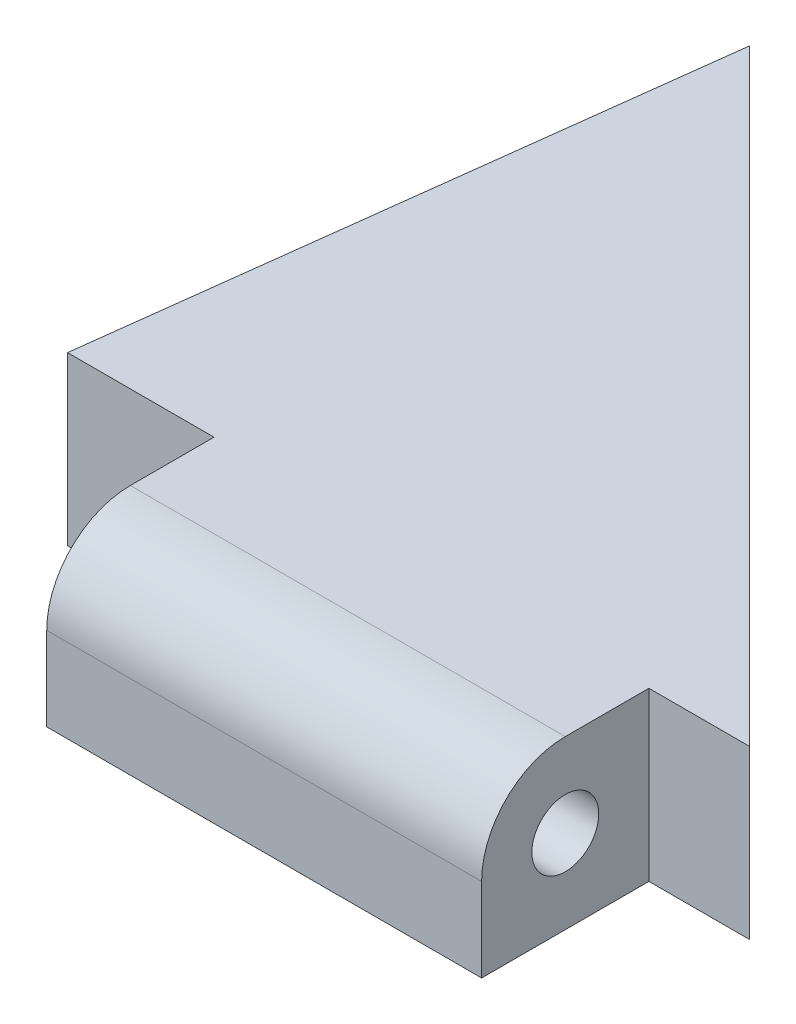
ISO-10303-21;
HEADER;
FILE_DESCRIPTION(('STEP AP214'),'2;1');
FILE_NAME('part.step','',(''),(''),'','','');
FILE_SCHEMA(('AUTOMOTIVE_DESIGN { 1 0 10303 214 1 1 1 1 }'));
ENDSEC;
DATA;
#1=APPLICATION_CONTEXT('core data for automotive mechanical design processes');
#2=APPLICATION_PROTOCOL_DEFINITION('international standard','automotive_design',2000,#1);
#3=PRODUCT_CONTEXT('',#1,'mechanical');
#4=PRODUCT('Part','Part','',(#3));
#5=PRODUCT_RELATED_PRODUCT_CATEGORY('part','',(#4));
#6=PRODUCT_DEFINITION_FORMATION('','',#4);
#7=PRODUCT_DEFINITION_CONTEXT('part definition',#1,'design');
#8=PRODUCT_DEFINITION('design','',#6,#7);
#9=PRODUCT_DEFINITION_SHAPE('','',#8);
#10=(LENGTH_UNIT() NAMED_UNIT(*) SI_UNIT(.MILLI.,.METRE.));
#11=(NAMED_UNIT(*) PLANE_ANGLE_UNIT() SI_UNIT($,.RADIAN.));
#12=(NAMED_UNIT(*) SI_UNIT($,.STERADIAN.) SOLID_ANGLE_UNIT());
#13=UNCERTAINTY_MEASURE_WITH_UNIT(LENGTH_MEASURE(1.E-05),#10,'distance_accuracy_value','');
#14=(GEOMETRIC_REPRESENTATION_CONTEXT(3) GLOBAL_UNCERTAINTY_ASSIGNED_CONTEXT((#13)) GLOBAL_UNIT_ASSIGNED_CONTEXT((#10,
#11,#12)) REPRESENTATION_CONTEXT('',''));
#15=CARTESIAN_POINT('',(0.,0.,0.));
#16=DIRECTION('',(0.,0.,1.));
#17=DIRECTION('',(1.,0.,0.));
#18=AXIS2_PLACEMENT_3D('',#15,#16,#17);
#19=CARTESIAN_POINT('',(0.,6.35,0.));
#20=DIRECTION('',(0.,0.,-1.));
#21=DIRECTION('',(-1.,0.,0.));
#22=AXIS2_PLACEMENT_3D('',#19,#20,#21);
#23=PLANE('',#22);
#24=DIRECTION('',(0.,1.,0.));
#25=VECTOR('',#24,1.);
#26=CARTESIAN_POINT('',(-3.81,0.,0.));
#27=LINE('',#26,#25);
#28=CARTESIAN_POINT('',(-3.81,0.,0.));
#29=VERTEX_POINT('',#28);
#30=CARTESIAN_POINT('',(-3.81,6.35,0.));
#31=VERTEX_POINT('',#30);
#32=EDGE_CURVE('E147',#29,#31,#27,.T.);
#33=ORIENTED_EDGE('',*,*,#32,.F.);
#34=DIRECTION('',(1.,0.,0.));
#35=VECTOR('',#34,1.);
#36=CARTESIAN_POINT('',(0.,0.,0.));
#37=LINE('',#36,#35);
#38=CARTESIAN_POINT('',(0.,0.,0.));
#39=VERTEX_POINT('',#38);
#40=EDGE_CURVE('E152',#29,#39,#37,.T.);
#41=ORIENTED_EDGE('',*,*,#40,.T.);
#42=DIRECTION('',(0.,-1.,0.));
#43=VECTOR('',#42,1.);
#44=CARTESIAN_POINT('',(0.,6.35,0.));
#45=LINE('',#44,#43);
#46=CARTESIAN_POINT('',(0.,6.35,0.));
#47=VERTEX_POINT('',#46);
#48=EDGE_CURVE('E11',#47,#39,#45,.T.);
#49=ORIENTED_EDGE('',*,*,#48,.F.);
#50=DIRECTION('',(1.,0.,0.));
#51=VECTOR('',#50,1.);
#52=CARTESIAN_POINT('',(0.,6.35,0.));
#53=LINE('',#52,#51);
#54=EDGE_CURVE('E80',#31,#47,#53,.T.);
#55=ORIENTED_EDGE('',*,*,#54,.F.);
#56=EDGE_LOOP('',(#33,#41,#49,#55));
#57=FACE_BOUND('',#56,.T.);
#58=ADVANCED_FACE('F34',(#57),#23,.F.);
#59=CARTESIAN_POINT('',(-25.881030621122,0.,0.));
#60=VERTEX_POINT('',#59);
#61=CARTESIAN_POINT('',(-20.32,0.,0.));
#62=VERTEX_POINT('',#61);
#63=EDGE_CURVE('E160',#60,#62,#37,.T.);
#64=ORIENTED_EDGE('',*,*,#63,.T.);
#65=DIRECTION('',(0.,1.,0.));
#66=VECTOR('',#65,1.);
#67=CARTESIAN_POINT('',(-20.32,0.,0.));
#68=LINE('',#67,#66);
#69=CARTESIAN_POINT('',(-20.32,6.35,0.));
#70=VERTEX_POINT('',#69);
#71=EDGE_CURVE('E136',#62,#70,#68,.T.);
#72=ORIENTED_EDGE('',*,*,#71,.T.);
#73=CARTESIAN_POINT('',(-25.881030621122,6.35,0.));
#74=VERTEX_POINT('',#73);
#75=EDGE_CURVE('E154',#74,#70,#53,.T.);
#76=ORIENTED_EDGE('',*,*,#75,.F.);
#77=DIRECTION('',(0.,-1.,0.));
#78=VECTOR('',#77,1.);
#79=CARTESIAN_POINT('',(-25.881030621122,6.35,0.));
#80=LINE('',#79,#78);
#81=EDGE_CURVE('E159',#74,#60,#80,.T.);
#82=ORIENTED_EDGE('',*,*,#81,.T.);
#83=EDGE_LOOP('',(#64,#72,#76,#82));
#84=FACE_BOUND('',#83,.T.);
#85=ADVANCED_FACE('F36',(#84),#23,.F.);
#86=CARTESIAN_POINT('',(-23.0207661252169,6.35,-23.0207661252167));
#87=DIRECTION('',(-0.707106781186544,0.,0.707106781186552));
#88=DIRECTION('',(0.707106781186552,0.,0.707106781186544));
#89=AXIS2_PLACEMENT_3D('',#86,#87,#88);
#90=PLANE('',#89);
#91=DIRECTION('',(-0.707106781186552,0.,-0.707106781186544));
#92=VECTOR('',#91,1.);
#93=CARTESIAN_POINT('',(-23.0207661252169,0.,-23.0207661252167));
#94=LINE('',#93,#92);
#95=CARTESIAN_POINT('',(-23.0207661252169,0.,-23.0207661252167));
#96=VERTEX_POINT('',#95);
#97=EDGE_CURVE('E163',#39,#96,#94,.T.);
#98=ORIENTED_EDGE('',*,*,#97,.T.);
#99=DIRECTION('',(0.,-1.,0.));
#100=VECTOR('',#99,1.);
#101=CARTESIAN_POINT('',(-23.0207661252169,6.35,-23.0207661252167));
#102=LINE('',#101,#100);
#103=CARTESIAN_POINT('',(-23.0207661252169,6.35,-23.0207661252167));
#104=VERTEX_POINT('',#103);
#105=EDGE_CURVE('E42',#104,#96,#102,.T.);
#106=ORIENTED_EDGE('',*,*,#105,.F.);
#107=DIRECTION('',(-0.707106781186552,0.,-0.707106781186544));
#108=VECTOR('',#107,1.);
#109=CARTESIAN_POINT('',(-23.0207661252169,6.35,-23.0207661252167));
#110=LINE('',#109,#108);
#111=EDGE_CURVE('E156',#47,#104,#110,.T.);
#112=ORIENTED_EDGE('',*,*,#111,.F.);
#113=ORIENTED_EDGE('',*,*,#48,.T.);
#114=EDGE_LOOP('',(#98,#106,#112,#113));
#115=FACE_BOUND('',#114,.T.);
#116=ADVANCED_FACE('F184',(#115),#90,.F.);
#117=CARTESIAN_POINT('',(-25.881030621122,6.35,0.));
#118=DIRECTION('',(0.992369555935665,0.,0.123299085365829));
#119=DIRECTION('',(0.123299085365829,0.,-0.992369555935666));
#120=AXIS2_PLACEMENT_3D('',#117,#118,#119);
#121=PLANE('',#120);
#122=DIRECTION('',(-0.123299085365829,0.,0.992369555935666));
#123=VECTOR('',#122,1.);
#124=CARTESIAN_POINT('',(-25.881030621122,0.,0.));
#125=LINE('',#124,#123);
#126=EDGE_CURVE('E75',#96,#60,#125,.T.);
#127=ORIENTED_EDGE('',*,*,#126,.T.);
#128=ORIENTED_EDGE('',*,*,#81,.F.);
#129=DIRECTION('',(-0.123299085365829,0.,0.992369555935666));
#130=VECTOR('',#129,1.);
#131=CARTESIAN_POINT('',(-25.881030621122,6.35,0.));
#132=LINE('',#131,#130);
#133=EDGE_CURVE('E58',#104,#74,#132,.T.);
#134=ORIENTED_EDGE('',*,*,#133,.F.);
#135=ORIENTED_EDGE('',*,*,#105,.T.);
#136=EDGE_LOOP('',(#127,#128,#134,#135));
#137=FACE_BOUND('',#136,.T.);
#138=ADVANCED_FACE('F167',(#137),#121,.F.);
#139=CARTESIAN_POINT('',(0.,6.35,0.));
#140=DIRECTION('',(0.,-1.,0.));
#141=DIRECTION('',(0.,0.,-1.));
#142=AXIS2_PLACEMENT_3D('',#139,#140,#141);
#143=PLANE('',#142);
#144=ORIENTED_EDGE('',*,*,#75,.T.);
#145=DIRECTION('',(0.,0.,-1.));
#146=VECTOR('',#145,1.);
#147=CARTESIAN_POINT('',(-20.32,6.35,0.));
#148=LINE('',#147,#146);
#149=CARTESIAN_POINT('',(-20.32,6.35,3.175));
#150=VERTEX_POINT('',#149);
#151=EDGE_CURVE('E49',#150,#70,#148,.T.);
#152=ORIENTED_EDGE('',*,*,#151,.F.);
#153=DIRECTION('',(1.,0.,0.));
#154=VECTOR('',#153,1.);
#155=CARTESIAN_POINT('',(-20.32,6.35,3.175));
#156=LINE('',#155,#154);
#157=CARTESIAN_POINT('',(-3.81,6.35,3.175));
#158=VERTEX_POINT('',#157);
#159=EDGE_CURVE('E128',#150,#158,#156,.T.);
#160=ORIENTED_EDGE('',*,*,#159,.T.);
#161=DIRECTION('',(0.,0.,-1.));
#162=VECTOR('',#161,1.);
#163=CARTESIAN_POINT('',(-3.81,6.35,0.));
#164=LINE('',#163,#162);
#165=EDGE_CURVE('E132',#158,#31,#164,.T.);
#166=ORIENTED_EDGE('',*,*,#165,.T.);
#167=ORIENTED_EDGE('',*,*,#54,.T.);
#168=ORIENTED_EDGE('',*,*,#111,.T.);
#169=ORIENTED_EDGE('',*,*,#133,.T.);
#170=EDGE_LOOP('',(#144,#152,#160,#166,#167,#168,#169));
#171=FACE_BOUND('',#170,.T.);
#172=ADVANCED_FACE('F176',(#171),#143,.F.);
#173=CARTESIAN_POINT('',(0.,0.,0.));
#174=DIRECTION('',(0.,-1.,0.));
#175=DIRECTION('',(0.,0.,-1.));
#176=AXIS2_PLACEMENT_3D('',#173,#174,#175);
#177=PLANE('',#176);
#178=ORIENTED_EDGE('',*,*,#63,.F.);
#179=ORIENTED_EDGE('',*,*,#126,.F.);
#180=ORIENTED_EDGE('',*,*,#97,.F.);
#181=ORIENTED_EDGE('',*,*,#40,.F.);
#182=DIRECTION('',(0.,0.,-1.));
#183=VECTOR('',#182,1.);
#184=CARTESIAN_POINT('',(-3.81,0.,0.));
#185=LINE('',#184,#183);
#186=CARTESIAN_POINT('',(-3.81,0.,6.35));
#187=VERTEX_POINT('',#186);
#188=EDGE_CURVE('E145',#187,#29,#185,.T.);
#189=ORIENTED_EDGE('',*,*,#188,.F.);
#190=DIRECTION('',(1.,0.,0.));
#191=VECTOR('',#190,1.);
#192=CARTESIAN_POINT('',(-20.32,0.,6.35));
#193=LINE('',#192,#191);
#194=CARTESIAN_POINT('',(-20.32,0.,6.35));
#195=VERTEX_POINT('',#194);
#196=EDGE_CURVE('E125',#195,#187,#193,.T.);
#197=ORIENTED_EDGE('',*,*,#196,.F.);
#198=DIRECTION('',(0.,0.,-1.));
#199=VECTOR('',#198,1.);
#200=CARTESIAN_POINT('',(-20.32,0.,0.));
#201=LINE('',#200,#199);
#202=EDGE_CURVE('E114',#195,#62,#201,.T.);
#203=ORIENTED_EDGE('',*,*,#202,.T.);
#204=EDGE_LOOP('',(#178,#179,#180,#181,#189,#197,#203));
#205=FACE_BOUND('',#204,.T.);
#206=ADVANCED_FACE('F172',(#205),#177,.T.);
#207=CARTESIAN_POINT('',(-20.32,3.175,3.175));
#208=DIRECTION('',(1.,0.,0.));
#209=DIRECTION('',(0.,0.,-1.));
#210=AXIS2_PLACEMENT_3D('',#207,#208,#209);
#211=CYLINDRICAL_SURFACE('',#210,3.175);
#212=CARTESIAN_POINT('',(-3.81,3.175,3.175));
#213=DIRECTION('',(1.,0.,0.));
#214=DIRECTION('',(0.,0.,-1.));
#215=AXIS2_PLACEMENT_3D('',#212,#213,#214);
#216=CIRCLE('',#215,3.175);
#217=CARTESIAN_POINT('',(-3.81,3.175,6.35));
#218=VERTEX_POINT('',#217);
#219=EDGE_CURVE('E142',#158,#218,#216,.T.);
#220=ORIENTED_EDGE('',*,*,#219,.F.);
#221=ORIENTED_EDGE('',*,*,#159,.F.);
#222=CARTESIAN_POINT('',(-20.32,3.175,3.175));
#223=DIRECTION('',(1.,0.,0.));
#224=DIRECTION('',(0.,0.,-1.));
#225=AXIS2_PLACEMENT_3D('',#222,#223,#224);
#226=CIRCLE('',#225,3.175);
#227=CARTESIAN_POINT('',(-20.32,3.175,6.35));
#228=VERTEX_POINT('',#227);
#229=EDGE_CURVE('E112',#150,#228,#226,.T.);
#230=ORIENTED_EDGE('',*,*,#229,.T.);
#231=DIRECTION('',(1.,0.,0.));
#232=VECTOR('',#231,1.);
#233=CARTESIAN_POINT('',(-20.32,3.175,6.35));
#234=LINE('',#233,#232);
#235=EDGE_CURVE('E118',#228,#218,#234,.T.);
#236=ORIENTED_EDGE('',*,*,#235,.T.);
#237=EDGE_LOOP('',(#220,#221,#230,#236));
#238=FACE_BOUND('',#237,.T.);
#239=ADVANCED_FACE('F127',(#238),#211,.T.);
#240=CARTESIAN_POINT('',(-20.32,3.175,3.175));
#241=DIRECTION('',(1.,0.,0.));
#242=DIRECTION('',(0.,0.,-1.));
#243=AXIS2_PLACEMENT_3D('',#240,#241,#242);
#244=CYLINDRICAL_SURFACE('',#243,1.27);
#245=CARTESIAN_POINT('',(-20.32,3.175,3.175));
#246=DIRECTION('',(1.,0.,0.));
#247=DIRECTION('',(0.,0.,-1.));
#248=AXIS2_PLACEMENT_3D('',#245,#246,#247);
#249=CIRCLE('',#248,1.27);
#250=CARTESIAN_POINT('',(-20.32,3.175,1.905));
#251=VERTEX_POINT('',#250);
#252=EDGE_CURVE('E129',#251,#251,#249,.T.);
#253=ORIENTED_EDGE('',*,*,#252,.F.);
#254=EDGE_LOOP('',(#253));
#255=FACE_BOUND('',#254,.T.);
#256=CARTESIAN_POINT('',(-3.81,3.175,3.175));
#257=DIRECTION('',(1.,0.,0.));
#258=DIRECTION('',(0.,0.,-1.));
#259=AXIS2_PLACEMENT_3D('',#256,#257,#258);
#260=CIRCLE('',#259,1.27);
#261=CARTESIAN_POINT('',(-3.81,3.175,1.905));
#262=VERTEX_POINT('',#261);
#263=EDGE_CURVE('E139',#262,#262,#260,.T.);
#264=ORIENTED_EDGE('',*,*,#263,.T.);
#265=EDGE_LOOP('',(#264));
#266=FACE_BOUND('',#265,.T.);
#267=ADVANCED_FACE('F227',(#255,#266),#244,.F.);
#268=CARTESIAN_POINT('',(-20.32,0.,6.35));
#269=DIRECTION('',(0.,0.,-1.));
#270=DIRECTION('',(-1.,0.,0.));
#271=AXIS2_PLACEMENT_3D('',#268,#269,#270);
#272=PLANE('',#271);
#273=DIRECTION('',(0.,1.,0.));
#274=VECTOR('',#273,1.);
#275=CARTESIAN_POINT('',(-3.81,0.,6.35));
#276=LINE('',#275,#274);
#277=EDGE_CURVE('E121',#187,#218,#276,.T.);
#278=ORIENTED_EDGE('',*,*,#277,.T.);
#279=ORIENTED_EDGE('',*,*,#235,.F.);
#280=DIRECTION('',(0.,1.,0.));
#281=VECTOR('',#280,1.);
#282=CARTESIAN_POINT('',(-20.32,0.,6.35));
#283=LINE('',#282,#281);
#284=EDGE_CURVE('E108',#195,#228,#283,.T.);
#285=ORIENTED_EDGE('',*,*,#284,.F.);
#286=ORIENTED_EDGE('',*,*,#196,.T.);
#287=EDGE_LOOP('',(#278,#279,#285,#286));
#288=FACE_BOUND('',#287,.T.);
#289=ADVANCED_FACE('F119',(#288),#272,.F.);
#290=CARTESIAN_POINT('',(-20.32,0.,0.));
#291=DIRECTION('',(1.,0.,0.));
#292=DIRECTION('',(0.,0.,-1.));
#293=AXIS2_PLACEMENT_3D('',#290,#291,#292);
#294=PLANE('',#293);
#295=ORIENTED_EDGE('',*,*,#252,.T.);
#296=EDGE_LOOP('',(#295));
#297=FACE_BOUND('',#296,.T.);
#298=ORIENTED_EDGE('',*,*,#229,.F.);
#299=ORIENTED_EDGE('',*,*,#151,.T.);
#300=ORIENTED_EDGE('',*,*,#71,.F.);
#301=ORIENTED_EDGE('',*,*,#202,.F.);
#302=ORIENTED_EDGE('',*,*,#284,.T.);
#303=EDGE_LOOP('',(#298,#299,#300,#301,#302));
#304=FACE_BOUND('',#303,.T.);
#305=ADVANCED_FACE('F110',(#297,#304),#294,.F.);
#306=CARTESIAN_POINT('',(-3.81,0.,0.));
#307=DIRECTION('',(1.,0.,0.));
#308=DIRECTION('',(0.,0.,-1.));
#309=AXIS2_PLACEMENT_3D('',#306,#307,#308);
#310=PLANE('',#309);
#311=ORIENTED_EDGE('',*,*,#263,.F.);
#312=EDGE_LOOP('',(#311));
#313=FACE_BOUND('',#312,.T.);
#314=ORIENTED_EDGE('',*,*,#219,.T.);
#315=ORIENTED_EDGE('',*,*,#277,.F.);
#316=ORIENTED_EDGE('',*,*,#188,.T.);
#317=ORIENTED_EDGE('',*,*,#32,.T.);
#318=ORIENTED_EDGE('',*,*,#165,.F.);
#319=EDGE_LOOP('',(#314,#315,#316,#317,#318));
#320=FACE_BOUND('',#319,.T.);
#321=ADVANCED_FACE('F179',(#313,#320),#310,.T.);
#322=CLOSED_SHELL('',(#58,#85,#116,#138,#172,#206,#239,#267,#289,#305,#321));
#323=MANIFOLD_SOLID_BREP('B2',#322);
#324=ADVANCED_BREP_SHAPE_REPRESENTATION('',(#18,#323),#14);
#325=SHAPE_DEFINITION_REPRESENTATION(#9,#324);
ENDSEC;
END-ISO-10303-21;
